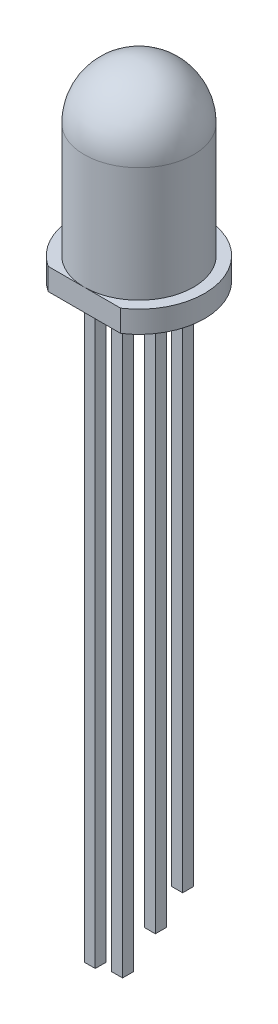
ISO-10303-21;
HEADER;
FILE_DESCRIPTION(('STEP AP214'),'2;1');
FILE_NAME('part.step','',(''),(''),'','','');
FILE_SCHEMA(('AUTOMOTIVE_DESIGN { 1 0 10303 214 1 1 1 1 }'));
ENDSEC;
DATA;
#1=APPLICATION_CONTEXT('core data for automotive mechanical design processes');
#2=APPLICATION_PROTOCOL_DEFINITION('international standard','automotive_design',2000,#1);
#3=PRODUCT_CONTEXT('',#1,'mechanical');
#4=PRODUCT('Part','Part','',(#3));
#5=PRODUCT_RELATED_PRODUCT_CATEGORY('part','',(#4));
#6=PRODUCT_DEFINITION_FORMATION('','',#4);
#7=PRODUCT_DEFINITION_CONTEXT('part definition',#1,'design');
#8=PRODUCT_DEFINITION('design','',#6,#7);
#9=PRODUCT_DEFINITION_SHAPE('','',#8);
#10=(LENGTH_UNIT() NAMED_UNIT(*) SI_UNIT(.MILLI.,.METRE.));
#11=(NAMED_UNIT(*) PLANE_ANGLE_UNIT() SI_UNIT($,.RADIAN.));
#12=(NAMED_UNIT(*) SI_UNIT($,.STERADIAN.) SOLID_ANGLE_UNIT());
#13=UNCERTAINTY_MEASURE_WITH_UNIT(LENGTH_MEASURE(1.E-05),#10,'distance_accuracy_value','');
#14=(GEOMETRIC_REPRESENTATION_CONTEXT(3) GLOBAL_UNCERTAINTY_ASSIGNED_CONTEXT((#13)) GLOBAL_UNIT_ASSIGNED_CONTEXT((#10,
#11,#12)) REPRESENTATION_CONTEXT('',''));
#15=CARTESIAN_POINT('',(0.,0.,0.));
#16=DIRECTION('',(0.,0.,1.));
#17=DIRECTION('',(1.,0.,0.));
#18=AXIS2_PLACEMENT_3D('',#15,#16,#17);
#19=CARTESIAN_POINT('',(0.25,-27.,2.25));
#20=DIRECTION('',(-1.,0.,0.));
#21=DIRECTION('',(0.,0.,1.));
#22=AXIS2_PLACEMENT_3D('',#19,#20,#21);
#23=PLANE('',#22);
#24=DIRECTION('',(0.,0.,1.));
#25=VECTOR('',#24,1.);
#26=CARTESIAN_POINT('',(0.25,-26.,2.25));
#27=LINE('',#26,#25);
#28=CARTESIAN_POINT('',(0.25,-26.,1.75));
#29=VERTEX_POINT('',#28);
#30=CARTESIAN_POINT('',(0.25,-26.,2.25));
#31=VERTEX_POINT('',#30);
#32=EDGE_CURVE('E315',#29,#31,#27,.T.);
#33=ORIENTED_EDGE('',*,*,#32,.F.);
#34=DIRECTION('',(0.,1.,0.));
#35=VECTOR('',#34,1.);
#36=CARTESIAN_POINT('',(0.25,-27.,1.75));
#37=LINE('',#36,#35);
#38=CARTESIAN_POINT('',(0.25,0.,1.75));
#39=VERTEX_POINT('',#38);
#40=EDGE_CURVE('E267',#29,#39,#37,.T.);
#41=ORIENTED_EDGE('',*,*,#40,.T.);
#42=DIRECTION('',(0.,0.,1.));
#43=VECTOR('',#42,1.);
#44=CARTESIAN_POINT('',(0.25,0.,2.25));
#45=LINE('',#44,#43);
#46=CARTESIAN_POINT('',(0.25,0.,2.25));
#47=VERTEX_POINT('',#46);
#48=EDGE_CURVE('E248',#39,#47,#45,.T.);
#49=ORIENTED_EDGE('',*,*,#48,.T.);
#50=DIRECTION('',(0.,1.,0.));
#51=VECTOR('',#50,1.);
#52=CARTESIAN_POINT('',(0.25,-27.,2.25));
#53=LINE('',#52,#51);
#54=EDGE_CURVE('E273',#31,#47,#53,.T.);
#55=ORIENTED_EDGE('',*,*,#54,.F.);
#56=EDGE_LOOP('',(#33,#41,#49,#55));
#57=FACE_BOUND('',#56,.T.);
#58=ADVANCED_FACE('F39',(#57),#23,.F.);
#59=CARTESIAN_POINT('',(-0.25,-27.,2.25));
#60=DIRECTION('',(0.,0.,-1.));
#61=DIRECTION('',(-1.,0.,0.));
#62=AXIS2_PLACEMENT_3D('',#59,#60,#61);
#63=PLANE('',#62);
#64=DIRECTION('',(-1.,0.,0.));
#65=VECTOR('',#64,1.);
#66=CARTESIAN_POINT('',(3.,-26.,2.25));
#67=LINE('',#66,#65);
#68=CARTESIAN_POINT('',(-0.25,-26.,2.25));
#69=VERTEX_POINT('',#68);
#70=EDGE_CURVE('E327',#31,#69,#67,.T.);
#71=ORIENTED_EDGE('',*,*,#70,.F.);
#72=ORIENTED_EDGE('',*,*,#54,.T.);
#73=DIRECTION('',(-1.,0.,0.));
#74=VECTOR('',#73,1.);
#75=CARTESIAN_POINT('',(-0.25,0.,2.25));
#76=LINE('',#75,#74);
#77=CARTESIAN_POINT('',(-0.25,0.,2.25));
#78=VERTEX_POINT('',#77);
#79=EDGE_CURVE('E258',#47,#78,#76,.T.);
#80=ORIENTED_EDGE('',*,*,#79,.T.);
#81=DIRECTION('',(0.,1.,0.));
#82=VECTOR('',#81,1.);
#83=CARTESIAN_POINT('',(-0.25,-27.,2.25));
#84=LINE('',#83,#82);
#85=EDGE_CURVE('E271',#69,#78,#84,.T.);
#86=ORIENTED_EDGE('',*,*,#85,.F.);
#87=EDGE_LOOP('',(#71,#72,#80,#86));
#88=FACE_BOUND('',#87,.T.);
#89=ADVANCED_FACE('F345',(#88),#63,.F.);
#90=CARTESIAN_POINT('',(-0.25,-27.,2.25));
#91=DIRECTION('',(1.,0.,0.));
#92=DIRECTION('',(0.,0.,-1.));
#93=AXIS2_PLACEMENT_3D('',#90,#91,#92);
#94=PLANE('',#93);
#95=DIRECTION('',(0.,0.,-1.));
#96=VECTOR('',#95,1.);
#97=CARTESIAN_POINT('',(-0.25,-26.,2.25));
#98=LINE('',#97,#96);
#99=CARTESIAN_POINT('',(-0.25,-26.,1.75));
#100=VERTEX_POINT('',#99);
#101=EDGE_CURVE('E62',#69,#100,#98,.T.);
#102=ORIENTED_EDGE('',*,*,#101,.F.);
#103=ORIENTED_EDGE('',*,*,#85,.T.);
#104=DIRECTION('',(0.,0.,-1.));
#105=VECTOR('',#104,1.);
#106=CARTESIAN_POINT('',(-0.25,0.,2.25));
#107=LINE('',#106,#105);
#108=CARTESIAN_POINT('',(-0.25,0.,1.75));
#109=VERTEX_POINT('',#108);
#110=EDGE_CURVE('E261',#78,#109,#107,.T.);
#111=ORIENTED_EDGE('',*,*,#110,.T.);
#112=DIRECTION('',(0.,1.,0.));
#113=VECTOR('',#112,1.);
#114=CARTESIAN_POINT('',(-0.25,-27.,1.75));
#115=LINE('',#114,#113);
#116=EDGE_CURVE('E269',#100,#109,#115,.T.);
#117=ORIENTED_EDGE('',*,*,#116,.F.);
#118=EDGE_LOOP('',(#102,#103,#111,#117));
#119=FACE_BOUND('',#118,.T.);
#120=ADVANCED_FACE('F352',(#119),#94,.F.);
#121=CARTESIAN_POINT('',(-0.25,-27.,1.75));
#122=DIRECTION('',(0.,0.,1.));
#123=DIRECTION('',(1.,0.,0.));
#124=AXIS2_PLACEMENT_3D('',#121,#122,#123);
#125=PLANE('',#124);
#126=DIRECTION('',(-1.,0.,0.));
#127=VECTOR('',#126,1.);
#128=CARTESIAN_POINT('',(3.,-26.,1.75));
#129=LINE('',#128,#127);
#130=EDGE_CURVE('E324',#29,#100,#129,.T.);
#131=ORIENTED_EDGE('',*,*,#130,.T.);
#132=ORIENTED_EDGE('',*,*,#116,.T.);
#133=DIRECTION('',(1.,0.,0.));
#134=VECTOR('',#133,1.);
#135=CARTESIAN_POINT('',(-0.25,0.,1.75));
#136=LINE('',#135,#134);
#137=EDGE_CURVE('E264',#109,#39,#136,.T.);
#138=ORIENTED_EDGE('',*,*,#137,.T.);
#139=ORIENTED_EDGE('',*,*,#40,.F.);
#140=EDGE_LOOP('',(#131,#132,#138,#139));
#141=FACE_BOUND('',#140,.T.);
#142=ADVANCED_FACE('F501',(#141),#125,.F.);
#143=CARTESIAN_POINT('',(0.25,-27.,-0.5));
#144=DIRECTION('',(-1.,0.,0.));
#145=DIRECTION('',(0.,0.,1.));
#146=AXIS2_PLACEMENT_3D('',#143,#144,#145);
#147=PLANE('',#146);
#148=DIRECTION('',(0.,0.,1.));
#149=VECTOR('',#148,1.);
#150=CARTESIAN_POINT('',(0.25,-26.,-0.5));
#151=LINE('',#150,#149);
#152=CARTESIAN_POINT('',(0.25,-26.,-1.));
#153=VERTEX_POINT('',#152);
#154=CARTESIAN_POINT('',(0.25,-26.,-0.5));
#155=VERTEX_POINT('',#154);
#156=EDGE_CURVE('E320',#153,#155,#151,.T.);
#157=ORIENTED_EDGE('',*,*,#156,.F.);
#158=DIRECTION('',(0.,1.,0.));
#159=VECTOR('',#158,1.);
#160=CARTESIAN_POINT('',(0.25,-27.,-1.));
#161=LINE('',#160,#159);
#162=CARTESIAN_POINT('',(0.25,0.,-1.));
#163=VERTEX_POINT('',#162);
#164=EDGE_CURVE('E208',#153,#163,#161,.T.);
#165=ORIENTED_EDGE('',*,*,#164,.T.);
#166=DIRECTION('',(0.,0.,1.));
#167=VECTOR('',#166,1.);
#168=CARTESIAN_POINT('',(0.25,0.,-0.5));
#169=LINE('',#168,#167);
#170=CARTESIAN_POINT('',(0.25,0.,-0.5));
#171=VERTEX_POINT('',#170);
#172=EDGE_CURVE('E219',#163,#171,#169,.T.);
#173=ORIENTED_EDGE('',*,*,#172,.T.);
#174=DIRECTION('',(0.,1.,0.));
#175=VECTOR('',#174,1.);
#176=CARTESIAN_POINT('',(0.25,-27.,-0.5));
#177=LINE('',#176,#175);
#178=EDGE_CURVE('E202',#155,#171,#177,.T.);
#179=ORIENTED_EDGE('',*,*,#178,.F.);
#180=EDGE_LOOP('',(#157,#165,#173,#179));
#181=FACE_BOUND('',#180,.T.);
#182=ADVANCED_FACE('F492',(#181),#147,.F.);
#183=CARTESIAN_POINT('',(-0.25,-27.,-0.5));
#184=DIRECTION('',(0.,0.,-1.));
#185=DIRECTION('',(-1.,0.,0.));
#186=AXIS2_PLACEMENT_3D('',#183,#184,#185);
#187=PLANE('',#186);
#188=DIRECTION('',(-1.,0.,0.));
#189=VECTOR('',#188,1.);
#190=CARTESIAN_POINT('',(3.,-26.,-0.5));
#191=LINE('',#190,#189);
#192=CARTESIAN_POINT('',(-0.25,-26.,-0.5));
#193=VERTEX_POINT('',#192);
#194=EDGE_CURVE('E325',#155,#193,#191,.T.);
#195=ORIENTED_EDGE('',*,*,#194,.F.);
#196=ORIENTED_EDGE('',*,*,#178,.T.);
#197=DIRECTION('',(-1.,0.,0.));
#198=VECTOR('',#197,1.);
#199=CARTESIAN_POINT('',(-0.25,0.,-0.5));
#200=LINE('',#199,#198);
#201=CARTESIAN_POINT('',(-0.25,0.,-0.5));
#202=VERTEX_POINT('',#201);
#203=EDGE_CURVE('E216',#171,#202,#200,.T.);
#204=ORIENTED_EDGE('',*,*,#203,.T.);
#205=DIRECTION('',(0.,1.,0.));
#206=VECTOR('',#205,1.);
#207=CARTESIAN_POINT('',(-0.25,-27.,-0.5));
#208=LINE('',#207,#206);
#209=EDGE_CURVE('E204',#193,#202,#208,.T.);
#210=ORIENTED_EDGE('',*,*,#209,.F.);
#211=EDGE_LOOP('',(#195,#196,#204,#210));
#212=FACE_BOUND('',#211,.T.);
#213=ADVANCED_FACE('F483',(#212),#187,.F.);
#214=CARTESIAN_POINT('',(-0.25,-27.,-0.5));
#215=DIRECTION('',(1.,0.,0.));
#216=DIRECTION('',(0.,0.,-1.));
#217=AXIS2_PLACEMENT_3D('',#214,#215,#216);
#218=PLANE('',#217);
#219=DIRECTION('',(0.,0.,-1.));
#220=VECTOR('',#219,1.);
#221=CARTESIAN_POINT('',(-0.25,-26.,-0.5));
#222=LINE('',#221,#220);
#223=CARTESIAN_POINT('',(-0.25,-26.,-1.));
#224=VERTEX_POINT('',#223);
#225=EDGE_CURVE('E322',#193,#224,#222,.T.);
#226=ORIENTED_EDGE('',*,*,#225,.F.);
#227=ORIENTED_EDGE('',*,*,#209,.T.);
#228=DIRECTION('',(0.,0.,-1.));
#229=VECTOR('',#228,1.);
#230=CARTESIAN_POINT('',(-0.25,0.,-0.5));
#231=LINE('',#230,#229);
#232=CARTESIAN_POINT('',(-0.25,0.,-1.));
#233=VERTEX_POINT('',#232);
#234=EDGE_CURVE('E213',#202,#233,#231,.T.);
#235=ORIENTED_EDGE('',*,*,#234,.T.);
#236=DIRECTION('',(0.,1.,0.));
#237=VECTOR('',#236,1.);
#238=CARTESIAN_POINT('',(-0.25,-27.,-1.));
#239=LINE('',#238,#237);
#240=EDGE_CURVE('E206',#224,#233,#239,.T.);
#241=ORIENTED_EDGE('',*,*,#240,.F.);
#242=EDGE_LOOP('',(#226,#227,#235,#241));
#243=FACE_BOUND('',#242,.T.);
#244=ADVANCED_FACE('F474',(#243),#218,.F.);
#245=CARTESIAN_POINT('',(-0.25,-27.,-1.));
#246=DIRECTION('',(0.,0.,1.));
#247=DIRECTION('',(1.,0.,0.));
#248=AXIS2_PLACEMENT_3D('',#245,#246,#247);
#249=PLANE('',#248);
#250=DIRECTION('',(-1.,0.,0.));
#251=VECTOR('',#250,1.);
#252=CARTESIAN_POINT('',(3.,-26.,-1.));
#253=LINE('',#252,#251);
#254=EDGE_CURVE('E181',#153,#224,#253,.T.);
#255=ORIENTED_EDGE('',*,*,#254,.T.);
#256=ORIENTED_EDGE('',*,*,#240,.T.);
#257=DIRECTION('',(1.,0.,0.));
#258=VECTOR('',#257,1.);
#259=CARTESIAN_POINT('',(-0.25,0.,-1.));
#260=LINE('',#259,#258);
#261=EDGE_CURVE('E210',#233,#163,#260,.T.);
#262=ORIENTED_EDGE('',*,*,#261,.T.);
#263=ORIENTED_EDGE('',*,*,#164,.F.);
#264=EDGE_LOOP('',(#255,#256,#262,#263));
#265=FACE_BOUND('',#264,.T.);
#266=ADVANCED_FACE('F307',(#265),#249,.F.);
#267=CARTESIAN_POINT('',(0.,0.,0.));
#268=DIRECTION('',(0.,1.,0.));
#269=DIRECTION('',(0.,0.,1.));
#270=AXIS2_PLACEMENT_3D('',#267,#268,#269);
#271=PLANE('',#270);
#272=ORIENTED_EDGE('',*,*,#172,.F.);
#273=ORIENTED_EDGE('',*,*,#261,.F.);
#274=ORIENTED_EDGE('',*,*,#234,.F.);
#275=ORIENTED_EDGE('',*,*,#203,.F.);
#276=EDGE_LOOP('',(#272,#273,#274,#275));
#277=FACE_BOUND('',#276,.T.);
#278=ORIENTED_EDGE('',*,*,#48,.F.);
#279=ORIENTED_EDGE('',*,*,#137,.F.);
#280=ORIENTED_EDGE('',*,*,#110,.F.);
#281=ORIENTED_EDGE('',*,*,#79,.F.);
#282=EDGE_LOOP('',(#278,#279,#280,#281));
#283=FACE_BOUND('',#282,.T.);
#284=DIRECTION('',(-1.,0.,0.));
#285=VECTOR('',#284,1.);
#286=CARTESIAN_POINT('',(-1.6583123951777,0.,2.5));
#287=LINE('',#286,#285);
#288=CARTESIAN_POINT('',(1.6583123951777,0.,2.5));
#289=VERTEX_POINT('',#288);
#290=CARTESIAN_POINT('',(-1.6583123951777,0.,2.5));
#291=VERTEX_POINT('',#290);
#292=EDGE_CURVE('E275',#289,#291,#287,.T.);
#293=ORIENTED_EDGE('',*,*,#292,.T.);
#294=CARTESIAN_POINT('',(0.,0.,0.));
#295=DIRECTION('',(0.,1.,0.));
#296=DIRECTION('',(0.,0.,1.));
#297=AXIS2_PLACEMENT_3D('',#294,#295,#296);
#298=CIRCLE('',#297,3.);
#299=EDGE_CURVE('E11',#289,#291,#298,.T.);
#300=ORIENTED_EDGE('',*,*,#299,.F.);
#301=EDGE_LOOP('',(#293,#300));
#302=FACE_BOUND('',#301,.T.);
#303=DIRECTION('',(0.,0.,1.));
#304=VECTOR('',#303,1.);
#305=CARTESIAN_POINT('',(0.25,0.,1.));
#306=LINE('',#305,#304);
#307=CARTESIAN_POINT('',(0.25,0.,0.5));
#308=VERTEX_POINT('',#307);
#309=CARTESIAN_POINT('',(0.25,0.,1.));
#310=VERTEX_POINT('',#309);
#311=EDGE_CURVE('E245',#308,#310,#306,.T.);
#312=ORIENTED_EDGE('',*,*,#311,.F.);
#313=DIRECTION('',(1.,0.,0.));
#314=VECTOR('',#313,1.);
#315=CARTESIAN_POINT('',(-0.25,0.,0.5));
#316=LINE('',#315,#314);
#317=CARTESIAN_POINT('',(-0.25,0.,0.5));
#318=VERTEX_POINT('',#317);
#319=EDGE_CURVE('E235',#318,#308,#316,.T.);
#320=ORIENTED_EDGE('',*,*,#319,.F.);
#321=DIRECTION('',(0.,0.,-1.));
#322=VECTOR('',#321,1.);
#323=CARTESIAN_POINT('',(-0.25,0.,1.));
#324=LINE('',#323,#322);
#325=CARTESIAN_POINT('',(-0.25,0.,1.));
#326=VERTEX_POINT('',#325);
#327=EDGE_CURVE('E238',#326,#318,#324,.T.);
#328=ORIENTED_EDGE('',*,*,#327,.F.);
#329=DIRECTION('',(-1.,0.,0.));
#330=VECTOR('',#329,1.);
#331=CARTESIAN_POINT('',(-0.25,0.,1.));
#332=LINE('',#331,#330);
#333=EDGE_CURVE('E242',#310,#326,#332,.T.);
#334=ORIENTED_EDGE('',*,*,#333,.F.);
#335=EDGE_LOOP('',(#312,#320,#328,#334));
#336=FACE_BOUND('',#335,.T.);
#337=DIRECTION('',(0.,0.,1.));
#338=VECTOR('',#337,1.);
#339=CARTESIAN_POINT('',(0.25,0.,-1.75));
#340=LINE('',#339,#338);
#341=CARTESIAN_POINT('',(0.25,0.,-2.25));
#342=VERTEX_POINT('',#341);
#343=CARTESIAN_POINT('',(0.25,0.,-1.75));
#344=VERTEX_POINT('',#343);
#345=EDGE_CURVE('E200',#342,#344,#340,.T.);
#346=ORIENTED_EDGE('',*,*,#345,.F.);
#347=DIRECTION('',(1.,0.,0.));
#348=VECTOR('',#347,1.);
#349=CARTESIAN_POINT('',(-0.25,0.,-2.25));
#350=LINE('',#349,#348);
#351=CARTESIAN_POINT('',(-0.25,0.,-2.25));
#352=VERTEX_POINT('',#351);
#353=EDGE_CURVE('E186',#352,#342,#350,.T.);
#354=ORIENTED_EDGE('',*,*,#353,.F.);
#355=DIRECTION('',(0.,0.,-1.));
#356=VECTOR('',#355,1.);
#357=CARTESIAN_POINT('',(-0.25,0.,-1.75));
#358=LINE('',#357,#356);
#359=CARTESIAN_POINT('',(-0.25,0.,-1.75));
#360=VERTEX_POINT('',#359);
#361=EDGE_CURVE('E189',#360,#352,#358,.T.);
#362=ORIENTED_EDGE('',*,*,#361,.F.);
#363=DIRECTION('',(-1.,0.,0.));
#364=VECTOR('',#363,1.);
#365=CARTESIAN_POINT('',(-0.25,0.,-1.75));
#366=LINE('',#365,#364);
#367=EDGE_CURVE('E197',#344,#360,#366,.T.);
#368=ORIENTED_EDGE('',*,*,#367,.F.);
#369=EDGE_LOOP('',(#346,#354,#362,#368));
#370=FACE_BOUND('',#369,.T.);
#371=ADVANCED_FACE('F41',(#277,#283,#302,#336,#370),#271,.F.);
#372=CARTESIAN_POINT('',(0.,8.75,0.));
#373=DIRECTION('',(0.,1.,0.));
#374=DIRECTION('',(0.,0.,1.));
#375=AXIS2_PLACEMENT_3D('',#372,#373,#374);
#376=CYLINDRICAL_SURFACE('',#375,3.);
#377=DIRECTION('',(0.,-1.,0.));
#378=VECTOR('',#377,1.);
#379=CARTESIAN_POINT('',(1.6583123951777,10.,2.5));
#380=LINE('',#379,#378);
#381=CARTESIAN_POINT('',(1.6583123951777,0.999999999999999,2.5));
#382=VERTEX_POINT('',#381);
#383=EDGE_CURVE('E280',#382,#289,#380,.T.);
#384=ORIENTED_EDGE('',*,*,#383,.T.);
#385=ORIENTED_EDGE('',*,*,#299,.T.);
#386=DIRECTION('',(0.,-1.,0.));
#387=VECTOR('',#386,1.);
#388=CARTESIAN_POINT('',(-1.6583123951777,10.,2.5));
#389=LINE('',#388,#387);
#390=CARTESIAN_POINT('',(-1.6583123951777,0.999999999999999,2.5));
#391=VERTEX_POINT('',#390);
#392=EDGE_CURVE('E278',#391,#291,#389,.T.);
#393=ORIENTED_EDGE('',*,*,#392,.F.);
#394=CARTESIAN_POINT('',(0.,1.,0.));
#395=DIRECTION('',(0.,1.,0.));
#396=DIRECTION('',(0.,0.,1.));
#397=AXIS2_PLACEMENT_3D('',#394,#395,#396);
#398=CIRCLE('',#397,3.);
#399=EDGE_CURVE('E47',#382,#391,#398,.T.);
#400=ORIENTED_EDGE('',*,*,#399,.F.);
#401=EDGE_LOOP('',(#384,#385,#393,#400));
#402=FACE_BOUND('',#401,.T.);
#403=ADVANCED_FACE('F300',(#402),#376,.T.);
#404=CARTESIAN_POINT('',(0.,1.,-3.));
#405=DIRECTION('',(0.,-1.,0.));
#406=DIRECTION('',(0.,0.,-1.));
#407=AXIS2_PLACEMENT_3D('',#404,#405,#406);
#408=PLANE('',#407);
#409=DIRECTION('',(-1.,0.,0.));
#410=VECTOR('',#409,1.);
#411=CARTESIAN_POINT('',(0.,1.,2.5));
#412=LINE('',#411,#410);
#413=CARTESIAN_POINT('',(0.,1.,2.5));
#414=VERTEX_POINT('',#413);
#415=EDGE_CURVE('E285',#382,#414,#412,.T.);
#416=ORIENTED_EDGE('',*,*,#415,.F.);
#417=ORIENTED_EDGE('',*,*,#399,.T.);
#418=EDGE_CURVE('E283',#414,#391,#412,.T.);
#419=ORIENTED_EDGE('',*,*,#418,.F.);
#420=CARTESIAN_POINT('',(0.,1.,0.));
#421=DIRECTION('',(0.,1.,0.));
#422=DIRECTION('',(0.,0.,1.));
#423=AXIS2_PLACEMENT_3D('',#420,#421,#422);
#424=CIRCLE('',#423,2.5);
#425=EDGE_CURVE('E289',#414,#414,#424,.T.);
#426=ORIENTED_EDGE('',*,*,#425,.F.);
#427=EDGE_LOOP('',(#416,#417,#419,#426));
#428=FACE_BOUND('',#427,.T.);
#429=ADVANCED_FACE('F296',(#428),#408,.F.);
#430=CARTESIAN_POINT('',(0.,8.75,0.));
#431=DIRECTION('',(0.,1.,0.));
#432=DIRECTION('',(0.,0.,1.));
#433=AXIS2_PLACEMENT_3D('',#430,#431,#432);
#434=CYLINDRICAL_SURFACE('',#433,2.5);
#435=CARTESIAN_POINT('',(0.,6.25,0.));
#436=DIRECTION('',(0.,1.,0.));
#437=DIRECTION('',(0.,0.,1.));
#438=AXIS2_PLACEMENT_3D('',#435,#436,#437);
#439=CIRCLE('',#438,2.5);
#440=CARTESIAN_POINT('',(0.,6.25,2.5));
#441=VERTEX_POINT('',#440);
#442=EDGE_CURVE('E286',#441,#441,#439,.T.);
#443=ORIENTED_EDGE('',*,*,#442,.F.);
#444=EDGE_LOOP('',(#443));
#445=FACE_BOUND('',#444,.T.);
#446=ORIENTED_EDGE('',*,*,#425,.T.);
#447=EDGE_LOOP('',(#446));
#448=FACE_BOUND('',#447,.T.);
#449=ADVANCED_FACE('F364',(#445,#448),#434,.T.);
#450=CARTESIAN_POINT('',(0.,6.25,0.));
#451=DIRECTION('',(0.,1.,0.));
#452=DIRECTION('',(0.,0.,-1.));
#453=AXIS2_PLACEMENT_3D('',#450,#451,#452);
#454=SPHERICAL_SURFACE('',#453,2.5);
#455=ORIENTED_EDGE('',*,*,#442,.T.);
#456=EDGE_LOOP('',(#455));
#457=FACE_BOUND('',#456,.T.);
#458=ADVANCED_FACE('F361',(#457),#454,.T.);
#459=CARTESIAN_POINT('',(-1.6583123951777,10.,2.5));
#460=DIRECTION('',(0.,0.,1.));
#461=DIRECTION('',(1.,0.,0.));
#462=AXIS2_PLACEMENT_3D('',#459,#460,#461);
#463=PLANE('',#462);
#464=ORIENTED_EDGE('',*,*,#415,.T.);
#465=ORIENTED_EDGE('',*,*,#418,.T.);
#466=ORIENTED_EDGE('',*,*,#392,.T.);
#467=ORIENTED_EDGE('',*,*,#292,.F.);
#468=ORIENTED_EDGE('',*,*,#383,.F.);
#469=EDGE_LOOP('',(#464,#465,#466,#467,#468));
#470=FACE_BOUND('',#469,.T.);
#471=ADVANCED_FACE('F303',(#470),#463,.T.);
#472=CARTESIAN_POINT('',(0.25,-27.,1.));
#473=DIRECTION('',(-1.,0.,0.));
#474=DIRECTION('',(0.,0.,1.));
#475=AXIS2_PLACEMENT_3D('',#472,#473,#474);
#476=PLANE('',#475);
#477=ORIENTED_EDGE('',*,*,#311,.T.);
#478=DIRECTION('',(0.,1.,0.));
#479=VECTOR('',#478,1.);
#480=CARTESIAN_POINT('',(0.25,-27.,1.));
#481=LINE('',#480,#479);
#482=CARTESIAN_POINT('',(0.25,-27.,1.));
#483=VERTEX_POINT('',#482);
#484=EDGE_CURVE('E222',#483,#310,#481,.T.);
#485=ORIENTED_EDGE('',*,*,#484,.F.);
#486=DIRECTION('',(0.,0.,1.));
#487=VECTOR('',#486,1.);
#488=CARTESIAN_POINT('',(0.25,-27.,1.));
#489=LINE('',#488,#487);
#490=CARTESIAN_POINT('',(0.25,-27.,0.5));
#491=VERTEX_POINT('',#490);
#492=EDGE_CURVE('E239',#491,#483,#489,.T.);
#493=ORIENTED_EDGE('',*,*,#492,.F.);
#494=DIRECTION('',(0.,1.,0.));
#495=VECTOR('',#494,1.);
#496=CARTESIAN_POINT('',(0.25,-27.,0.5));
#497=LINE('',#496,#495);
#498=EDGE_CURVE('E231',#491,#308,#497,.T.);
#499=ORIENTED_EDGE('',*,*,#498,.T.);
#500=EDGE_LOOP('',(#477,#485,#493,#499));
#501=FACE_BOUND('',#500,.T.);
#502=ADVANCED_FACE('F360',(#501),#476,.F.);
#503=CARTESIAN_POINT('',(-0.25,-27.,1.));
#504=DIRECTION('',(0.,0.,-1.));
#505=DIRECTION('',(-1.,0.,0.));
#506=AXIS2_PLACEMENT_3D('',#503,#504,#505);
#507=PLANE('',#506);
#508=ORIENTED_EDGE('',*,*,#333,.T.);
#509=DIRECTION('',(0.,1.,0.));
#510=VECTOR('',#509,1.);
#511=CARTESIAN_POINT('',(-0.25,-27.,1.));
#512=LINE('',#511,#510);
#513=CARTESIAN_POINT('',(-0.25,-27.,1.));
#514=VERTEX_POINT('',#513);
#515=EDGE_CURVE('E225',#514,#326,#512,.T.);
#516=ORIENTED_EDGE('',*,*,#515,.F.);
#517=DIRECTION('',(-1.,0.,0.));
#518=VECTOR('',#517,1.);
#519=CARTESIAN_POINT('',(-0.25,-27.,1.));
#520=LINE('',#519,#518);
#521=EDGE_CURVE('E252',#483,#514,#520,.T.);
#522=ORIENTED_EDGE('',*,*,#521,.F.);
#523=ORIENTED_EDGE('',*,*,#484,.T.);
#524=EDGE_LOOP('',(#508,#516,#522,#523));
#525=FACE_BOUND('',#524,.T.);
#526=ADVANCED_FACE('F403',(#525),#507,.F.);
#527=CARTESIAN_POINT('',(-0.25,-27.,1.));
#528=DIRECTION('',(1.,0.,0.));
#529=DIRECTION('',(0.,0.,-1.));
#530=AXIS2_PLACEMENT_3D('',#527,#528,#529);
#531=PLANE('',#530);
#532=ORIENTED_EDGE('',*,*,#327,.T.);
#533=DIRECTION('',(0.,1.,0.));
#534=VECTOR('',#533,1.);
#535=CARTESIAN_POINT('',(-0.25,-27.,0.5));
#536=LINE('',#535,#534);
#537=CARTESIAN_POINT('',(-0.25,-27.,0.5));
#538=VERTEX_POINT('',#537);
#539=EDGE_CURVE('E228',#538,#318,#536,.T.);
#540=ORIENTED_EDGE('',*,*,#539,.F.);
#541=DIRECTION('',(0.,0.,-1.));
#542=VECTOR('',#541,1.);
#543=CARTESIAN_POINT('',(-0.25,-27.,1.));
#544=LINE('',#543,#542);
#545=EDGE_CURVE('E250',#514,#538,#544,.T.);
#546=ORIENTED_EDGE('',*,*,#545,.F.);
#547=ORIENTED_EDGE('',*,*,#515,.T.);
#548=EDGE_LOOP('',(#532,#540,#546,#547));
#549=FACE_BOUND('',#548,.T.);
#550=ADVANCED_FACE('F411',(#549),#531,.F.);
#551=CARTESIAN_POINT('',(-0.25,-27.,0.5));
#552=DIRECTION('',(0.,0.,1.));
#553=DIRECTION('',(1.,0.,0.));
#554=AXIS2_PLACEMENT_3D('',#551,#552,#553);
#555=PLANE('',#554);
#556=ORIENTED_EDGE('',*,*,#319,.T.);
#557=ORIENTED_EDGE('',*,*,#498,.F.);
#558=DIRECTION('',(1.,0.,0.));
#559=VECTOR('',#558,1.);
#560=CARTESIAN_POINT('',(-0.25,-27.,0.5));
#561=LINE('',#560,#559);
#562=EDGE_CURVE('E234',#538,#491,#561,.T.);
#563=ORIENTED_EDGE('',*,*,#562,.F.);
#564=ORIENTED_EDGE('',*,*,#539,.T.);
#565=EDGE_LOOP('',(#556,#557,#563,#564));
#566=FACE_BOUND('',#565,.T.);
#567=ADVANCED_FACE('F420',(#566),#555,.F.);
#568=CARTESIAN_POINT('',(0.,-27.,0.));
#569=DIRECTION('',(0.,-1.,0.));
#570=DIRECTION('',(0.,0.,-1.));
#571=AXIS2_PLACEMENT_3D('',#568,#569,#570);
#572=PLANE('',#571);
#573=ORIENTED_EDGE('',*,*,#492,.T.);
#574=ORIENTED_EDGE('',*,*,#521,.T.);
#575=ORIENTED_EDGE('',*,*,#545,.T.);
#576=ORIENTED_EDGE('',*,*,#562,.T.);
#577=EDGE_LOOP('',(#573,#574,#575,#576));
#578=FACE_BOUND('',#577,.T.);
#579=ADVANCED_FACE('F428',(#578),#572,.T.);
#580=CARTESIAN_POINT('',(0.25,-27.,-1.75));
#581=DIRECTION('',(-1.,0.,0.));
#582=DIRECTION('',(0.,0.,1.));
#583=AXIS2_PLACEMENT_3D('',#580,#581,#582);
#584=PLANE('',#583);
#585=DIRECTION('',(0.,1.,0.));
#586=VECTOR('',#585,1.);
#587=CARTESIAN_POINT('',(0.25,-27.,-1.75));
#588=LINE('',#587,#586);
#589=CARTESIAN_POINT('',(0.25,-25.,-1.75));
#590=VERTEX_POINT('',#589);
#591=EDGE_CURVE('E180',#590,#344,#588,.T.);
#592=ORIENTED_EDGE('',*,*,#591,.F.);
#593=DIRECTION('',(0.,0.,-1.));
#594=VECTOR('',#593,1.);
#595=CARTESIAN_POINT('',(0.25,-25.,-1.75));
#596=LINE('',#595,#594);
#597=CARTESIAN_POINT('',(0.25,-25.,-2.25));
#598=VERTEX_POINT('',#597);
#599=EDGE_CURVE('E167',#590,#598,#596,.T.);
#600=ORIENTED_EDGE('',*,*,#599,.T.);
#601=DIRECTION('',(0.,1.,0.));
#602=VECTOR('',#601,1.);
#603=CARTESIAN_POINT('',(0.25,-27.,-2.25));
#604=LINE('',#603,#602);
#605=EDGE_CURVE('E178',#598,#342,#604,.T.);
#606=ORIENTED_EDGE('',*,*,#605,.T.);
#607=ORIENTED_EDGE('',*,*,#345,.T.);
#608=EDGE_LOOP('',(#592,#600,#606,#607));
#609=FACE_BOUND('',#608,.T.);
#610=ADVANCED_FACE('F176',(#609),#584,.F.);
#611=CARTESIAN_POINT('',(-0.25,-27.,-1.75));
#612=DIRECTION('',(0.,0.,-1.));
#613=DIRECTION('',(-1.,0.,0.));
#614=AXIS2_PLACEMENT_3D('',#611,#612,#613);
#615=PLANE('',#614);
#616=DIRECTION('',(0.,1.,0.));
#617=VECTOR('',#616,1.);
#618=CARTESIAN_POINT('',(-0.25,-27.,-1.75));
#619=LINE('',#618,#617);
#620=CARTESIAN_POINT('',(-0.25,-25.,-1.75));
#621=VERTEX_POINT('',#620);
#622=EDGE_CURVE('E191',#621,#360,#619,.T.);
#623=ORIENTED_EDGE('',*,*,#622,.F.);
#624=DIRECTION('',(1.,0.,0.));
#625=VECTOR('',#624,1.);
#626=CARTESIAN_POINT('',(-3.,-25.,-1.75));
#627=LINE('',#626,#625);
#628=EDGE_CURVE('E172',#621,#590,#627,.T.);
#629=ORIENTED_EDGE('',*,*,#628,.T.);
#630=ORIENTED_EDGE('',*,*,#591,.T.);
#631=ORIENTED_EDGE('',*,*,#367,.T.);
#632=EDGE_LOOP('',(#623,#629,#630,#631));
#633=FACE_BOUND('',#632,.T.);
#634=ADVANCED_FACE('F314',(#633),#615,.F.);
#635=CARTESIAN_POINT('',(-0.25,-27.,-1.75));
#636=DIRECTION('',(1.,0.,0.));
#637=DIRECTION('',(0.,0.,-1.));
#638=AXIS2_PLACEMENT_3D('',#635,#636,#637);
#639=PLANE('',#638);
#640=DIRECTION('',(0.,1.,0.));
#641=VECTOR('',#640,1.);
#642=CARTESIAN_POINT('',(-0.25,-27.,-2.25));
#643=LINE('',#642,#641);
#644=CARTESIAN_POINT('',(-0.25,-25.,-2.25));
#645=VERTEX_POINT('',#644);
#646=EDGE_CURVE('E187',#645,#352,#643,.T.);
#647=ORIENTED_EDGE('',*,*,#646,.F.);
#648=DIRECTION('',(0.,0.,1.));
#649=VECTOR('',#648,1.);
#650=CARTESIAN_POINT('',(-0.25,-25.,-1.75));
#651=LINE('',#650,#649);
#652=EDGE_CURVE('E54',#645,#621,#651,.T.);
#653=ORIENTED_EDGE('',*,*,#652,.T.);
#654=ORIENTED_EDGE('',*,*,#622,.T.);
#655=ORIENTED_EDGE('',*,*,#361,.T.);
#656=EDGE_LOOP('',(#647,#653,#654,#655));
#657=FACE_BOUND('',#656,.T.);
#658=ADVANCED_FACE('F334',(#657),#639,.F.);
#659=CARTESIAN_POINT('',(-0.25,-27.,-2.25));
#660=DIRECTION('',(0.,0.,1.));
#661=DIRECTION('',(1.,0.,0.));
#662=AXIS2_PLACEMENT_3D('',#659,#660,#661);
#663=PLANE('',#662);
#664=ORIENTED_EDGE('',*,*,#605,.F.);
#665=DIRECTION('',(1.,0.,0.));
#666=VECTOR('',#665,1.);
#667=CARTESIAN_POINT('',(-3.,-25.,-2.25));
#668=LINE('',#667,#666);
#669=EDGE_CURVE('E164',#645,#598,#668,.T.);
#670=ORIENTED_EDGE('',*,*,#669,.F.);
#671=ORIENTED_EDGE('',*,*,#646,.T.);
#672=ORIENTED_EDGE('',*,*,#353,.T.);
#673=EDGE_LOOP('',(#664,#670,#671,#672));
#674=FACE_BOUND('',#673,.T.);
#675=ADVANCED_FACE('F184',(#674),#663,.F.);
#676=CARTESIAN_POINT('',(3.,-26.,-0.5));
#677=DIRECTION('',(0.,-1.,0.));
#678=DIRECTION('',(0.,0.,-1.));
#679=AXIS2_PLACEMENT_3D('',#676,#677,#678);
#680=PLANE('',#679);
#681=ORIENTED_EDGE('',*,*,#156,.T.);
#682=ORIENTED_EDGE('',*,*,#194,.T.);
#683=ORIENTED_EDGE('',*,*,#225,.T.);
#684=ORIENTED_EDGE('',*,*,#254,.F.);
#685=EDGE_LOOP('',(#681,#682,#683,#684));
#686=FACE_BOUND('',#685,.T.);
#687=ADVANCED_FACE('F341',(#686),#680,.T.);
#688=CARTESIAN_POINT('',(3.,-26.,2.25));
#689=DIRECTION('',(0.,-1.,0.));
#690=DIRECTION('',(0.,0.,-1.));
#691=AXIS2_PLACEMENT_3D('',#688,#689,#690);
#692=PLANE('',#691);
#693=ORIENTED_EDGE('',*,*,#32,.T.);
#694=ORIENTED_EDGE('',*,*,#70,.T.);
#695=ORIENTED_EDGE('',*,*,#101,.T.);
#696=ORIENTED_EDGE('',*,*,#130,.F.);
#697=EDGE_LOOP('',(#693,#694,#695,#696));
#698=FACE_BOUND('',#697,.T.);
#699=ADVANCED_FACE('F534',(#698),#692,.T.);
#700=CARTESIAN_POINT('',(-3.,-25.,-1.75));
#701=DIRECTION('',(0.,1.,0.));
#702=DIRECTION('',(0.,0.,1.));
#703=AXIS2_PLACEMENT_3D('',#700,#701,#702);
#704=PLANE('',#703);
#705=ORIENTED_EDGE('',*,*,#628,.F.);
#706=ORIENTED_EDGE('',*,*,#652,.F.);
#707=ORIENTED_EDGE('',*,*,#669,.T.);
#708=ORIENTED_EDGE('',*,*,#599,.F.);
#709=EDGE_LOOP('',(#705,#706,#707,#708));
#710=FACE_BOUND('',#709,.T.);
#711=ADVANCED_FACE('F166',(#710),#704,.F.);
#712=CLOSED_SHELL('',(#58,#89,#120,#142,#182,#213,#244,#266,#371,#403,#429,#449,#458,#471,#502,
#526,#550,#567,#579,#610,#634,#658,#675,#687,#699,#711));
#713=MANIFOLD_SOLID_BREP('B2',#712);
#714=ADVANCED_BREP_SHAPE_REPRESENTATION('',(#18,#713),#14);
#715=SHAPE_DEFINITION_REPRESENTATION(#9,#714);
ENDSEC;
END-ISO-10303-21;
